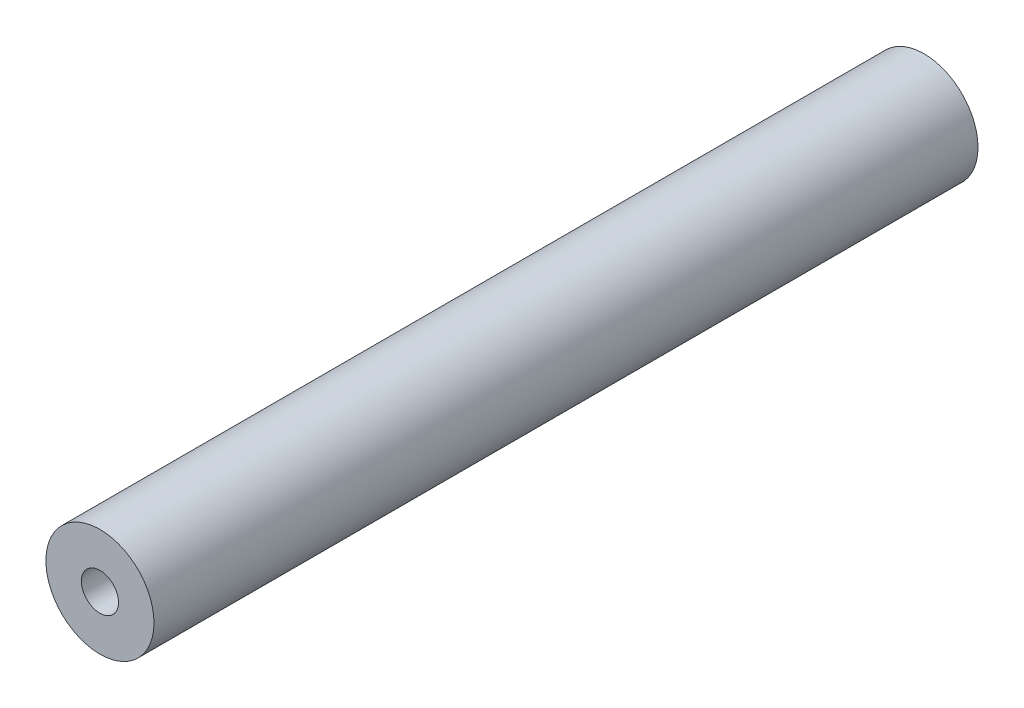
ISO-10303-21;
HEADER;
FILE_DESCRIPTION(('STEP AP214'),'2;1');
FILE_NAME('part.step','',(''),(''),'','','');
FILE_SCHEMA(('AUTOMOTIVE_DESIGN { 1 0 10303 214 1 1 1 1 }'));
ENDSEC;
DATA;
#1=APPLICATION_CONTEXT('core data for automotive mechanical design processes');
#2=APPLICATION_PROTOCOL_DEFINITION('international standard','automotive_design',2000,#1);
#3=PRODUCT_CONTEXT('',#1,'mechanical');
#4=PRODUCT('Part','Part','',(#3));
#5=PRODUCT_RELATED_PRODUCT_CATEGORY('part','',(#4));
#6=PRODUCT_DEFINITION_FORMATION('','',#4);
#7=PRODUCT_DEFINITION_CONTEXT('part definition',#1,'design');
#8=PRODUCT_DEFINITION('design','',#6,#7);
#9=PRODUCT_DEFINITION_SHAPE('','',#8);
#10=(LENGTH_UNIT() NAMED_UNIT(*) SI_UNIT(.MILLI.,.METRE.));
#11=(NAMED_UNIT(*) PLANE_ANGLE_UNIT() SI_UNIT($,.RADIAN.));
#12=(NAMED_UNIT(*) SI_UNIT($,.STERADIAN.) SOLID_ANGLE_UNIT());
#13=UNCERTAINTY_MEASURE_WITH_UNIT(LENGTH_MEASURE(1.E-05),#10,'distance_accuracy_value','');
#14=(GEOMETRIC_REPRESENTATION_CONTEXT(3) GLOBAL_UNCERTAINTY_ASSIGNED_CONTEXT((#13)) GLOBAL_UNIT_ASSIGNED_CONTEXT((#10,
#11,#12)) REPRESENTATION_CONTEXT('',''));
#15=CARTESIAN_POINT('',(0.,0.,0.));
#16=DIRECTION('',(0.,0.,1.));
#17=DIRECTION('',(1.,0.,0.));
#18=AXIS2_PLACEMENT_3D('',#15,#16,#17);
#19=CARTESIAN_POINT('',(0.,0.,60.98));
#20=DIRECTION('',(0.,0.,-1.));
#21=DIRECTION('',(-1.,0.,0.));
#22=AXIS2_PLACEMENT_3D('',#19,#20,#21);
#23=CYLINDRICAL_SURFACE('',#22,4.);
#24=CARTESIAN_POINT('',(0.,0.,60.98));
#25=DIRECTION('',(0.,0.,1.));
#26=DIRECTION('',(1.,0.,0.));
#27=AXIS2_PLACEMENT_3D('',#24,#25,#26);
#28=CIRCLE('',#27,4.);
#29=CARTESIAN_POINT('',(4.,0.,60.98));
#30=VERTEX_POINT('',#29);
#31=EDGE_CURVE('E12',#30,#30,#28,.T.);
#32=ORIENTED_EDGE('',*,*,#31,.F.);
#33=EDGE_LOOP('',(#32));
#34=FACE_BOUND('',#33,.T.);
#35=CARTESIAN_POINT('',(0.,0.,0.));
#36=DIRECTION('',(0.,0.,1.));
#37=DIRECTION('',(1.,0.,0.));
#38=AXIS2_PLACEMENT_3D('',#35,#36,#37);
#39=CIRCLE('',#38,4.);
#40=CARTESIAN_POINT('',(4.,0.,0.));
#41=VERTEX_POINT('',#40);
#42=EDGE_CURVE('E45',#41,#41,#39,.T.);
#43=ORIENTED_EDGE('',*,*,#42,.T.);
#44=EDGE_LOOP('',(#43));
#45=FACE_BOUND('',#44,.T.);
#46=ADVANCED_FACE('F42',(#34,#45),#23,.T.);
#47=CARTESIAN_POINT('',(0.,0.,60.98));
#48=DIRECTION('',(0.,0.,1.));
#49=DIRECTION('',(1.,0.,0.));
#50=AXIS2_PLACEMENT_3D('',#47,#48,#49);
#51=PLANE('',#50);
#52=CARTESIAN_POINT('',(0.,0.,60.98));
#53=DIRECTION('',(0.,0.,-1.));
#54=DIRECTION('',(-1.,0.,0.));
#55=AXIS2_PLACEMENT_3D('',#52,#53,#54);
#56=CIRCLE('',#55,1.375);
#57=CARTESIAN_POINT('',(-1.375,0.,60.98));
#58=VERTEX_POINT('',#57);
#59=EDGE_CURVE('E52',#58,#58,#56,.T.);
#60=ORIENTED_EDGE('',*,*,#59,.T.);
#61=EDGE_LOOP('',(#60));
#62=FACE_BOUND('',#61,.T.);
#63=ORIENTED_EDGE('',*,*,#31,.T.);
#64=EDGE_LOOP('',(#63));
#65=FACE_BOUND('',#64,.T.);
#66=ADVANCED_FACE('F60',(#62,#65),#51,.T.);
#67=CARTESIAN_POINT('',(0.,0.,0.));
#68=DIRECTION('',(0.,0.,1.));
#69=DIRECTION('',(1.,0.,0.));
#70=AXIS2_PLACEMENT_3D('',#67,#68,#69);
#71=PLANE('',#70);
#72=CARTESIAN_POINT('',(0.,0.,0.));
#73=DIRECTION('',(0.,0.,-1.));
#74=DIRECTION('',(-1.,0.,0.));
#75=AXIS2_PLACEMENT_3D('',#72,#73,#74);
#76=CIRCLE('',#75,1.375);
#77=CARTESIAN_POINT('',(-1.375,0.,0.));
#78=VERTEX_POINT('',#77);
#79=EDGE_CURVE('E54',#78,#78,#76,.T.);
#80=ORIENTED_EDGE('',*,*,#79,.F.);
#81=EDGE_LOOP('',(#80));
#82=FACE_BOUND('',#81,.T.);
#83=ORIENTED_EDGE('',*,*,#42,.F.);
#84=EDGE_LOOP('',(#83));
#85=FACE_BOUND('',#84,.T.);
#86=ADVANCED_FACE('F65',(#82,#85),#71,.F.);
#87=CARTESIAN_POINT('',(0.,0.,60.98));
#88=DIRECTION('',(0.,0.,-1.));
#89=DIRECTION('',(-1.,0.,0.));
#90=AXIS2_PLACEMENT_3D('',#87,#88,#89);
#91=CYLINDRICAL_SURFACE('',#90,1.375);
#92=ORIENTED_EDGE('',*,*,#59,.F.);
#93=EDGE_LOOP('',(#92));
#94=FACE_BOUND('',#93,.T.);
#95=ORIENTED_EDGE('',*,*,#79,.T.);
#96=EDGE_LOOP('',(#95));
#97=FACE_BOUND('',#96,.T.);
#98=ADVANCED_FACE('F62',(#94,#97),#91,.F.);
#99=CLOSED_SHELL('',(#46,#66,#86,#98));
#100=MANIFOLD_SOLID_BREP('B2',#99);
#101=ADVANCED_BREP_SHAPE_REPRESENTATION('',(#18,#100),#14);
#102=SHAPE_DEFINITION_REPRESENTATION(#9,#101);
ENDSEC;
END-ISO-10303-21;
